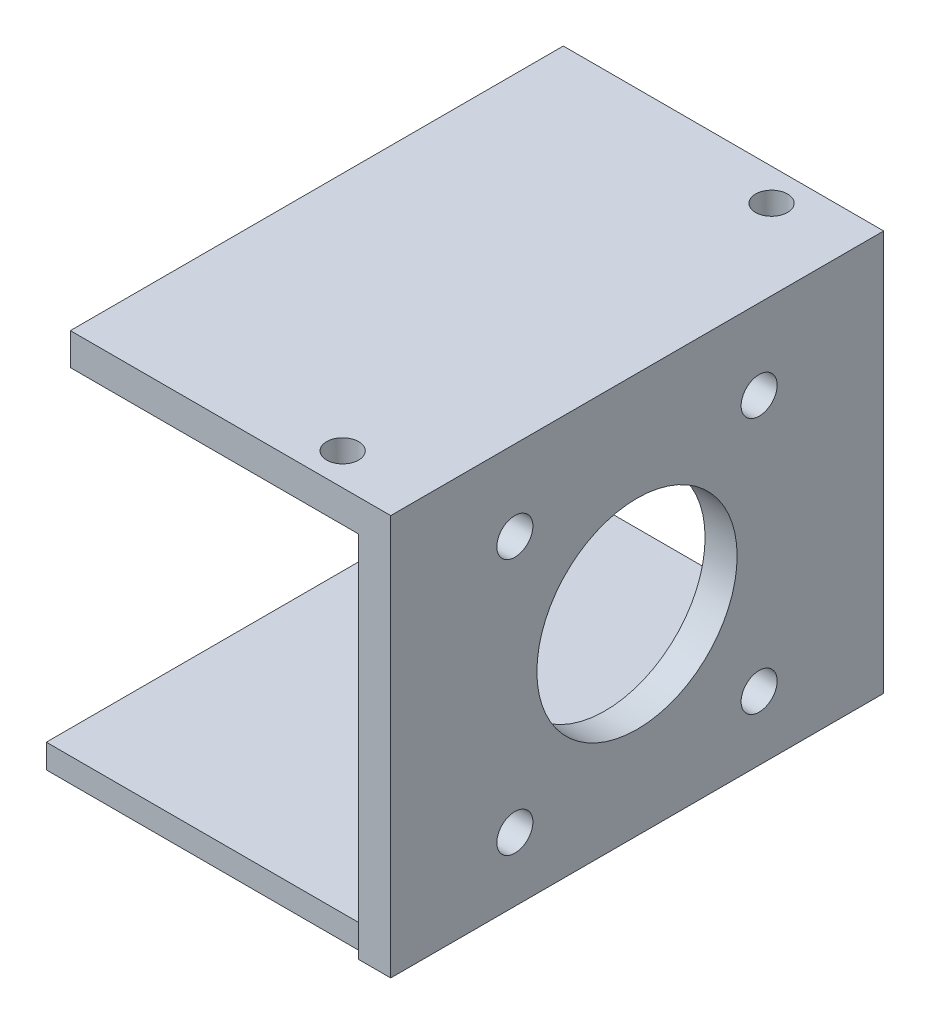
ISO-10303-21;
HEADER;
FILE_DESCRIPTION(('STEP AP214'),'2;1');
FILE_NAME('part.step','',(''),(''),'','','');
FILE_SCHEMA(('AUTOMOTIVE_DESIGN { 1 0 10303 214 1 1 1 1 }'));
ENDSEC;
DATA;
#1=APPLICATION_CONTEXT('core data for automotive mechanical design processes');
#2=APPLICATION_PROTOCOL_DEFINITION('international standard','automotive_design',2000,#1);
#3=PRODUCT_CONTEXT('',#1,'mechanical');
#4=PRODUCT('Part','Part','',(#3));
#5=PRODUCT_RELATED_PRODUCT_CATEGORY('part','',(#4));
#6=PRODUCT_DEFINITION_FORMATION('','',#4);
#7=PRODUCT_DEFINITION_CONTEXT('part definition',#1,'design');
#8=PRODUCT_DEFINITION('design','',#6,#7);
#9=PRODUCT_DEFINITION_SHAPE('','',#8);
#10=(LENGTH_UNIT() NAMED_UNIT(*) SI_UNIT(.MILLI.,.METRE.));
#11=(NAMED_UNIT(*) PLANE_ANGLE_UNIT() SI_UNIT($,.RADIAN.));
#12=(NAMED_UNIT(*) SI_UNIT($,.STERADIAN.) SOLID_ANGLE_UNIT());
#13=UNCERTAINTY_MEASURE_WITH_UNIT(LENGTH_MEASURE(1.E-05),#10,'distance_accuracy_value','');
#14=(GEOMETRIC_REPRESENTATION_CONTEXT(3) GLOBAL_UNCERTAINTY_ASSIGNED_CONTEXT((#13)) GLOBAL_UNIT_ASSIGNED_CONTEXT((#10,
#11,#12)) REPRESENTATION_CONTEXT('',''));
#15=CARTESIAN_POINT('',(0.,0.,0.));
#16=DIRECTION('',(0.,0.,1.));
#17=DIRECTION('',(1.,0.,0.));
#18=AXIS2_PLACEMENT_3D('',#15,#16,#17);
#19=CARTESIAN_POINT('',(40.,45.,-20.5));
#20=DIRECTION('',(1.,0.,0.));
#21=DIRECTION('',(0.,0.,-1.));
#22=AXIS2_PLACEMENT_3D('',#19,#20,#21);
#23=PLANE('',#22);
#24=CARTESIAN_POINT('',(40.,40.,15.5));
#25=DIRECTION('',(1.,0.,0.));
#26=DIRECTION('',(0.,0.,-1.));
#27=AXIS2_PLACEMENT_3D('',#24,#25,#26);
#28=CIRCLE('',#27,2.25);
#29=CARTESIAN_POINT('',(40.,40.,13.25));
#30=VERTEX_POINT('',#29);
#31=EDGE_CURVE('E226',#30,#30,#28,.T.);
#32=ORIENTED_EDGE('',*,*,#31,.T.);
#33=EDGE_LOOP('',(#32));
#34=FACE_BOUND('',#33,.T.);
#35=CARTESIAN_POINT('',(40.,40.,-15.));
#36=DIRECTION('',(1.,0.,0.));
#37=DIRECTION('',(0.,0.,-1.));
#38=AXIS2_PLACEMENT_3D('',#35,#36,#37);
#39=CIRCLE('',#38,2.25);
#40=CARTESIAN_POINT('',(40.,40.,-17.25));
#41=VERTEX_POINT('',#40);
#42=EDGE_CURVE('E227',#41,#41,#39,.T.);
#43=ORIENTED_EDGE('',*,*,#42,.T.);
#44=EDGE_LOOP('',(#43));
#45=FACE_BOUND('',#44,.T.);
#46=CARTESIAN_POINT('',(40.,8.,15.5));
#47=DIRECTION('',(1.,0.,0.));
#48=DIRECTION('',(0.,0.,-1.));
#49=AXIS2_PLACEMENT_3D('',#46,#47,#48);
#50=CIRCLE('',#49,2.25);
#51=CARTESIAN_POINT('',(40.,8.,13.25));
#52=VERTEX_POINT('',#51);
#53=EDGE_CURVE('E234',#52,#52,#50,.T.);
#54=ORIENTED_EDGE('',*,*,#53,.T.);
#55=EDGE_LOOP('',(#54));
#56=FACE_BOUND('',#55,.T.);
#57=CARTESIAN_POINT('',(40.,8.,-15.));
#58=DIRECTION('',(1.,0.,0.));
#59=DIRECTION('',(0.,0.,-1.));
#60=AXIS2_PLACEMENT_3D('',#57,#58,#59);
#61=CIRCLE('',#60,2.25);
#62=CARTESIAN_POINT('',(40.,8.,-17.25));
#63=VERTEX_POINT('',#62);
#64=EDGE_CURVE('E240',#63,#63,#61,.T.);
#65=ORIENTED_EDGE('',*,*,#64,.T.);
#66=EDGE_LOOP('',(#65));
#67=FACE_BOUND('',#66,.T.);
#68=CARTESIAN_POINT('',(40.,24.,0.250000000000002));
#69=DIRECTION('',(1.,0.,0.));
#70=DIRECTION('',(0.,0.,-1.));
#71=AXIS2_PLACEMENT_3D('',#68,#69,#70);
#72=CIRCLE('',#71,12.5);
#73=CARTESIAN_POINT('',(40.,24.,-12.25));
#74=VERTEX_POINT('',#73);
#75=EDGE_CURVE('E249',#74,#74,#72,.T.);
#76=ORIENTED_EDGE('',*,*,#75,.T.);
#77=EDGE_LOOP('',(#76));
#78=FACE_BOUND('',#77,.T.);
#79=DIRECTION('',(0.,-1.,0.));
#80=VECTOR('',#79,1.);
#81=CARTESIAN_POINT('',(40.,44.1126501213434,30.));
#82=LINE('',#81,#80);
#83=CARTESIAN_POINT('',(40.,3.,30.));
#84=VERTEX_POINT('',#83);
#85=CARTESIAN_POINT('',(40.,0.,30.));
#86=VERTEX_POINT('',#85);
#87=EDGE_CURVE('E171',#84,#86,#82,.T.);
#88=ORIENTED_EDGE('',*,*,#87,.T.);
#89=DIRECTION('',(0.,0.,1.));
#90=VECTOR('',#89,1.);
#91=CARTESIAN_POINT('',(40.,0.,21.));
#92=LINE('',#91,#90);
#93=CARTESIAN_POINT('',(40.,0.,31.));
#94=VERTEX_POINT('',#93);
#95=EDGE_CURVE('E207',#86,#94,#92,.T.);
#96=ORIENTED_EDGE('',*,*,#95,.T.);
#97=DIRECTION('',(0.,1.,0.));
#98=VECTOR('',#97,1.);
#99=CARTESIAN_POINT('',(40.,0.,31.));
#100=LINE('',#99,#98);
#101=CARTESIAN_POINT('',(40.,46.,31.));
#102=VERTEX_POINT('',#101);
#103=EDGE_CURVE('E204',#94,#102,#100,.T.);
#104=ORIENTED_EDGE('',*,*,#103,.T.);
#105=DIRECTION('',(0.,0.,-1.));
#106=VECTOR('',#105,1.);
#107=CARTESIAN_POINT('',(40.,46.,31.));
#108=LINE('',#107,#106);
#109=CARTESIAN_POINT('',(40.,46.,-30.5490564972375));
#110=VERTEX_POINT('',#109);
#111=EDGE_CURVE('E201',#102,#110,#108,.T.);
#112=ORIENTED_EDGE('',*,*,#111,.T.);
#113=DIRECTION('',(0.,-0.999999431346738,0.00106644559212024));
#114=VECTOR('',#113,1.);
#115=CARTESIAN_POINT('',(40.,46.,-30.5490564972375));
#116=LINE('',#115,#114);
#117=CARTESIAN_POINT('',(40.,2.6158050057826E-05,-30.5));
#118=VERTEX_POINT('',#117);
#119=EDGE_CURVE('E198',#110,#118,#116,.T.);
#120=ORIENTED_EDGE('',*,*,#119,.T.);
#121=DIRECTION('',(0.,0.,1.));
#122=VECTOR('',#121,1.);
#123=CARTESIAN_POINT('',(40.,2.6158050057826E-05,-20.5));
#124=LINE('',#123,#122);
#125=CARTESIAN_POINT('',(40.,2.6158050057826E-05,-30.));
#126=VERTEX_POINT('',#125);
#127=EDGE_CURVE('E195',#118,#126,#124,.T.);
#128=ORIENTED_EDGE('',*,*,#127,.T.);
#129=DIRECTION('',(0.,-1.,0.));
#130=VECTOR('',#129,1.);
#131=CARTESIAN_POINT('',(40.,44.1126501213434,-30.));
#132=LINE('',#131,#130);
#133=CARTESIAN_POINT('',(40.,3.,-30.));
#134=VERTEX_POINT('',#133);
#135=EDGE_CURVE('E181',#134,#126,#132,.T.);
#136=ORIENTED_EDGE('',*,*,#135,.F.);
#137=DIRECTION('',(0.,0.,-1.));
#138=VECTOR('',#137,1.);
#139=CARTESIAN_POINT('',(40.,3.,0.));
#140=LINE('',#139,#138);
#141=EDGE_CURVE('E44',#84,#134,#140,.T.);
#142=ORIENTED_EDGE('',*,*,#141,.F.);
#143=EDGE_LOOP('',(#88,#96,#104,#112,#120,#128,#136,#142));
#144=FACE_BOUND('',#143,.T.);
#145=ADVANCED_FACE('F35',(#34,#45,#56,#67,#78,#144),#23,.F.);
#146=CARTESIAN_POINT('',(0.,3.,-20.5));
#147=DIRECTION('',(0.,0.,1.));
#148=DIRECTION('',(1.,0.,0.));
#149=AXIS2_PLACEMENT_3D('',#146,#147,#148);
#150=PLANE('',#149);
#151=DIRECTION('',(0.,-1.,0.));
#152=VECTOR('',#151,1.);
#153=CARTESIAN_POINT('',(40.,44.1126501213434,-20.5));
#154=LINE('',#153,#152);
#155=CARTESIAN_POINT('',(40.,2.61580500593439E-05,-20.5));
#156=VERTEX_POINT('',#155);
#157=CARTESIAN_POINT('',(40.,0.,-20.5));
#158=VERTEX_POINT('',#157);
#159=EDGE_CURVE('E174',#156,#158,#154,.T.);
#160=ORIENTED_EDGE('',*,*,#159,.F.);
#161=DIRECTION('',(1.,0.,0.));
#162=VECTOR('',#161,1.);
#163=CARTESIAN_POINT('',(-36.839354211889,2.6158050057826E-05,-20.5));
#164=LINE('',#163,#162);
#165=CARTESIAN_POINT('',(44.,2.61580500732217E-05,-20.5));
#166=VERTEX_POINT('',#165);
#167=EDGE_CURVE('E214',#156,#166,#164,.T.);
#168=ORIENTED_EDGE('',*,*,#167,.T.);
#169=DIRECTION('',(0.,-1.,0.));
#170=VECTOR('',#169,1.);
#171=CARTESIAN_POINT('',(44.,45.,-20.5));
#172=LINE('',#171,#170);
#173=CARTESIAN_POINT('',(44.,0.,-20.5));
#174=VERTEX_POINT('',#173);
#175=EDGE_CURVE('E255',#166,#174,#172,.T.);
#176=ORIENTED_EDGE('',*,*,#175,.T.);
#177=DIRECTION('',(-1.,0.,0.));
#178=VECTOR('',#177,1.);
#179=CARTESIAN_POINT('',(0.,0.,-20.5));
#180=LINE('',#179,#178);
#181=EDGE_CURVE('E59',#174,#158,#180,.T.);
#182=ORIENTED_EDGE('',*,*,#181,.T.);
#183=EDGE_LOOP('',(#160,#168,#176,#182));
#184=FACE_BOUND('',#183,.T.);
#185=ADVANCED_FACE('F293',(#184),#150,.F.);
#186=CARTESIAN_POINT('',(0.,3.,0.));
#187=DIRECTION('',(1.,0.,0.));
#188=DIRECTION('',(0.,0.,-1.));
#189=AXIS2_PLACEMENT_3D('',#186,#187,#188);
#190=PLANE('',#189);
#191=DIRECTION('',(0.,0.,1.));
#192=VECTOR('',#191,1.);
#193=CARTESIAN_POINT('',(0.,0.,0.));
#194=LINE('',#193,#192);
#195=CARTESIAN_POINT('',(0.,0.,-30.));
#196=VERTEX_POINT('',#195);
#197=CARTESIAN_POINT('',(0.,0.,30.));
#198=VERTEX_POINT('',#197);
#199=EDGE_CURVE('E39',#196,#198,#194,.T.);
#200=ORIENTED_EDGE('',*,*,#199,.T.);
#201=DIRECTION('',(0.,-1.,0.));
#202=VECTOR('',#201,1.);
#203=CARTESIAN_POINT('',(0.,44.1126501213434,30.));
#204=LINE('',#203,#202);
#205=CARTESIAN_POINT('',(0.,3.,30.));
#206=VERTEX_POINT('',#205);
#207=EDGE_CURVE('E160',#206,#198,#204,.T.);
#208=ORIENTED_EDGE('',*,*,#207,.F.);
#209=DIRECTION('',(0.,0.,1.));
#210=VECTOR('',#209,1.);
#211=CARTESIAN_POINT('',(0.,3.,0.));
#212=LINE('',#211,#210);
#213=CARTESIAN_POINT('',(0.,3.,-30.));
#214=VERTEX_POINT('',#213);
#215=EDGE_CURVE('E11',#214,#206,#212,.T.);
#216=ORIENTED_EDGE('',*,*,#215,.F.);
#217=DIRECTION('',(0.,-1.,0.));
#218=VECTOR('',#217,1.);
#219=CARTESIAN_POINT('',(0.,44.1126501213434,-30.));
#220=LINE('',#219,#218);
#221=EDGE_CURVE('E180',#214,#196,#220,.T.);
#222=ORIENTED_EDGE('',*,*,#221,.T.);
#223=EDGE_LOOP('',(#200,#208,#216,#222));
#224=FACE_BOUND('',#223,.T.);
#225=ADVANCED_FACE('F271',(#224),#190,.F.);
#226=CARTESIAN_POINT('',(33.75,3.,-14.25));
#227=DIRECTION('',(0.,-1.,0.));
#228=DIRECTION('',(0.,0.,-1.));
#229=AXIS2_PLACEMENT_3D('',#226,#227,#228);
#230=CYLINDRICAL_SURFACE('',#229,2.5);
#231=CARTESIAN_POINT('',(33.75,3.,-14.25));
#232=DIRECTION('',(0.,1.,0.));
#233=DIRECTION('',(0.,0.,1.));
#234=AXIS2_PLACEMENT_3D('',#231,#232,#233);
#235=CIRCLE('',#234,2.5);
#236=CARTESIAN_POINT('',(33.75,3.,-11.75));
#237=VERTEX_POINT('',#236);
#238=EDGE_CURVE('E261',#237,#237,#235,.T.);
#239=ORIENTED_EDGE('',*,*,#238,.T.);
#240=EDGE_LOOP('',(#239));
#241=FACE_BOUND('',#240,.T.);
#242=CARTESIAN_POINT('',(33.75,0.,-14.25));
#243=DIRECTION('',(0.,1.,0.));
#244=DIRECTION('',(0.,0.,1.));
#245=AXIS2_PLACEMENT_3D('',#242,#243,#244);
#246=CIRCLE('',#245,2.5);
#247=CARTESIAN_POINT('',(33.75,0.,-11.75));
#248=VERTEX_POINT('',#247);
#249=EDGE_CURVE('E267',#248,#248,#246,.T.);
#250=ORIENTED_EDGE('',*,*,#249,.F.);
#251=EDGE_LOOP('',(#250));
#252=FACE_BOUND('',#251,.T.);
#253=ADVANCED_FACE('F365',(#241,#252),#230,.F.);
#254=CARTESIAN_POINT('',(33.75,3.,14.75));
#255=DIRECTION('',(0.,-1.,0.));
#256=DIRECTION('',(0.,0.,-1.));
#257=AXIS2_PLACEMENT_3D('',#254,#255,#256);
#258=CYLINDRICAL_SURFACE('',#257,2.5);
#259=CARTESIAN_POINT('',(33.75,3.,14.75));
#260=DIRECTION('',(0.,1.,0.));
#261=DIRECTION('',(0.,0.,1.));
#262=AXIS2_PLACEMENT_3D('',#259,#260,#261);
#263=CIRCLE('',#262,2.5);
#264=CARTESIAN_POINT('',(33.75,3.,17.25));
#265=VERTEX_POINT('',#264);
#266=EDGE_CURVE('E258',#265,#265,#263,.T.);
#267=ORIENTED_EDGE('',*,*,#266,.T.);
#268=EDGE_LOOP('',(#267));
#269=FACE_BOUND('',#268,.T.);
#270=CARTESIAN_POINT('',(33.75,0.,14.75));
#271=DIRECTION('',(0.,1.,0.));
#272=DIRECTION('',(0.,0.,1.));
#273=AXIS2_PLACEMENT_3D('',#270,#271,#272);
#274=CIRCLE('',#273,2.5);
#275=CARTESIAN_POINT('',(33.75,0.,17.25));
#276=VERTEX_POINT('',#275);
#277=EDGE_CURVE('E257',#276,#276,#274,.T.);
#278=ORIENTED_EDGE('',*,*,#277,.F.);
#279=EDGE_LOOP('',(#278));
#280=FACE_BOUND('',#279,.T.);
#281=ADVANCED_FACE('F37',(#269,#280),#258,.F.);
#282=CARTESIAN_POINT('',(0.,3.,0.));
#283=DIRECTION('',(0.,1.,0.));
#284=DIRECTION('',(0.,0.,1.));
#285=AXIS2_PLACEMENT_3D('',#282,#283,#284);
#286=PLANE('',#285);
#287=ORIENTED_EDGE('',*,*,#266,.F.);
#288=EDGE_LOOP('',(#287));
#289=FACE_BOUND('',#288,.T.);
#290=ORIENTED_EDGE('',*,*,#238,.F.);
#291=EDGE_LOOP('',(#290));
#292=FACE_BOUND('',#291,.T.);
#293=ORIENTED_EDGE('',*,*,#141,.T.);
#294=DIRECTION('',(-1.,0.,0.));
#295=VECTOR('',#294,1.);
#296=CARTESIAN_POINT('',(0.,3.,-30.));
#297=LINE('',#296,#295);
#298=EDGE_CURVE('E186',#134,#214,#297,.T.);
#299=ORIENTED_EDGE('',*,*,#298,.T.);
#300=ORIENTED_EDGE('',*,*,#215,.T.);
#301=DIRECTION('',(1.,0.,0.));
#302=VECTOR('',#301,1.);
#303=CARTESIAN_POINT('',(0.,3.,30.));
#304=LINE('',#303,#302);
#305=EDGE_CURVE('E172',#206,#84,#304,.T.);
#306=ORIENTED_EDGE('',*,*,#305,.T.);
#307=EDGE_LOOP('',(#293,#299,#300,#306));
#308=FACE_BOUND('',#307,.T.);
#309=ADVANCED_FACE('F284',(#289,#292,#308),#286,.T.);
#310=CARTESIAN_POINT('',(0.,0.,0.));
#311=DIRECTION('',(0.,1.,0.));
#312=DIRECTION('',(0.,0.,1.));
#313=AXIS2_PLACEMENT_3D('',#310,#311,#312);
#314=PLANE('',#313);
#315=DIRECTION('',(1.,0.,0.));
#316=VECTOR('',#315,1.);
#317=CARTESIAN_POINT('',(0.,0.,30.));
#318=LINE('',#317,#316);
#319=EDGE_CURVE('E163',#198,#86,#318,.T.);
#320=ORIENTED_EDGE('',*,*,#319,.F.);
#321=ORIENTED_EDGE('',*,*,#199,.F.);
#322=DIRECTION('',(-1.,0.,0.));
#323=VECTOR('',#322,1.);
#324=CARTESIAN_POINT('',(0.,0.,-30.));
#325=LINE('',#324,#323);
#326=CARTESIAN_POINT('',(40.,0.,-30.));
#327=VERTEX_POINT('',#326);
#328=EDGE_CURVE('E177',#327,#196,#325,.T.);
#329=ORIENTED_EDGE('',*,*,#328,.F.);
#330=DIRECTION('',(0.,0.,-1.));
#331=VECTOR('',#330,1.);
#332=CARTESIAN_POINT('',(40.,0.,-30.));
#333=LINE('',#332,#331);
#334=EDGE_CURVE('E182',#158,#327,#333,.T.);
#335=ORIENTED_EDGE('',*,*,#334,.F.);
#336=ORIENTED_EDGE('',*,*,#181,.F.);
#337=DIRECTION('',(0.,0.,-1.));
#338=VECTOR('',#337,1.);
#339=CARTESIAN_POINT('',(44.,0.,-20.5));
#340=LINE('',#339,#338);
#341=CARTESIAN_POINT('',(44.,0.,31.));
#342=VERTEX_POINT('',#341);
#343=EDGE_CURVE('E252',#342,#174,#340,.T.);
#344=ORIENTED_EDGE('',*,*,#343,.F.);
#345=DIRECTION('',(1.,0.,0.));
#346=VECTOR('',#345,1.);
#347=CARTESIAN_POINT('',(-36.839354211889,0.,31.));
#348=LINE('',#347,#346);
#349=EDGE_CURVE('E215',#94,#342,#348,.T.);
#350=ORIENTED_EDGE('',*,*,#349,.F.);
#351=ORIENTED_EDGE('',*,*,#95,.F.);
#352=EDGE_LOOP('',(#320,#321,#329,#335,#336,#344,#350,#351));
#353=FACE_BOUND('',#352,.T.);
#354=ORIENTED_EDGE('',*,*,#277,.T.);
#355=EDGE_LOOP('',(#354));
#356=FACE_BOUND('',#355,.T.);
#357=ORIENTED_EDGE('',*,*,#249,.T.);
#358=EDGE_LOOP('',(#357));
#359=FACE_BOUND('',#358,.T.);
#360=ADVANCED_FACE('F279',(#353,#356,#359),#314,.F.);
#361=CARTESIAN_POINT('',(44.,45.,-20.5));
#362=DIRECTION('',(-1.,0.,0.));
#363=DIRECTION('',(0.,0.,1.));
#364=AXIS2_PLACEMENT_3D('',#361,#362,#363);
#365=PLANE('',#364);
#366=DIRECTION('',(0.,-1.,0.));
#367=VECTOR('',#366,1.);
#368=CARTESIAN_POINT('',(44.,0.,31.));
#369=LINE('',#368,#367);
#370=CARTESIAN_POINT('',(44.,50.,31.));
#371=VERTEX_POINT('',#370);
#372=EDGE_CURVE('E212',#371,#342,#369,.T.);
#373=ORIENTED_EDGE('',*,*,#372,.T.);
#374=ORIENTED_EDGE('',*,*,#343,.T.);
#375=ORIENTED_EDGE('',*,*,#175,.F.);
#376=DIRECTION('',(0.,0.,-1.));
#377=VECTOR('',#376,1.);
#378=CARTESIAN_POINT('',(44.,2.6158050057826E-05,-20.5));
#379=LINE('',#378,#377);
#380=CARTESIAN_POINT('',(44.,2.6158050057826E-05,-30.5));
#381=VERTEX_POINT('',#380);
#382=EDGE_CURVE('E189',#166,#381,#379,.T.);
#383=ORIENTED_EDGE('',*,*,#382,.T.);
#384=DIRECTION('',(0.,0.999999431346738,-0.00106644559212024));
#385=VECTOR('',#384,1.);
#386=CARTESIAN_POINT('',(44.,46.,-30.5490564972375));
#387=LINE('',#386,#385);
#388=CARTESIAN_POINT('',(44.,46.,-30.5490564972375));
#389=VERTEX_POINT('',#388);
#390=EDGE_CURVE('E159',#381,#389,#387,.T.);
#391=ORIENTED_EDGE('',*,*,#390,.T.);
#392=DIRECTION('',(0.,-1.,0.));
#393=VECTOR('',#392,1.);
#394=CARTESIAN_POINT('',(44.,50.,-30.5490564972375));
#395=LINE('',#394,#393);
#396=CARTESIAN_POINT('',(44.,50.,-30.5490564972375));
#397=VERTEX_POINT('',#396);
#398=EDGE_CURVE('E135',#397,#389,#395,.T.);
#399=ORIENTED_EDGE('',*,*,#398,.F.);
#400=DIRECTION('',(0.,0.,-1.));
#401=VECTOR('',#400,1.);
#402=CARTESIAN_POINT('',(44.,50.,-30.5490564972375));
#403=LINE('',#402,#401);
#404=EDGE_CURVE('E142',#371,#397,#403,.T.);
#405=ORIENTED_EDGE('',*,*,#404,.F.);
#406=EDGE_LOOP('',(#373,#374,#375,#383,#391,#399,#405));
#407=FACE_BOUND('',#406,.T.);
#408=CARTESIAN_POINT('',(44.,40.,15.5));
#409=DIRECTION('',(-1.,0.,0.));
#410=DIRECTION('',(0.,0.,1.));
#411=AXIS2_PLACEMENT_3D('',#408,#409,#410);
#412=CIRCLE('',#411,2.25);
#413=CARTESIAN_POINT('',(44.,40.,17.75));
#414=VERTEX_POINT('',#413);
#415=EDGE_CURVE('E223',#414,#414,#412,.T.);
#416=ORIENTED_EDGE('',*,*,#415,.T.);
#417=EDGE_LOOP('',(#416));
#418=FACE_BOUND('',#417,.T.);
#419=CARTESIAN_POINT('',(44.,40.,-15.));
#420=DIRECTION('',(-1.,0.,0.));
#421=DIRECTION('',(0.,0.,1.));
#422=AXIS2_PLACEMENT_3D('',#419,#420,#421);
#423=CIRCLE('',#422,2.25);
#424=CARTESIAN_POINT('',(44.,40.,-12.75));
#425=VERTEX_POINT('',#424);
#426=EDGE_CURVE('E231',#425,#425,#423,.T.);
#427=ORIENTED_EDGE('',*,*,#426,.T.);
#428=EDGE_LOOP('',(#427));
#429=FACE_BOUND('',#428,.T.);
#430=CARTESIAN_POINT('',(44.,8.,15.5));
#431=DIRECTION('',(-1.,0.,0.));
#432=DIRECTION('',(0.,0.,1.));
#433=AXIS2_PLACEMENT_3D('',#430,#431,#432);
#434=CIRCLE('',#433,2.25);
#435=CARTESIAN_POINT('',(44.,8.,17.75));
#436=VERTEX_POINT('',#435);
#437=EDGE_CURVE('E237',#436,#436,#434,.T.);
#438=ORIENTED_EDGE('',*,*,#437,.T.);
#439=EDGE_LOOP('',(#438));
#440=FACE_BOUND('',#439,.T.);
#441=CARTESIAN_POINT('',(44.,8.,-15.));
#442=DIRECTION('',(-1.,0.,0.));
#443=DIRECTION('',(0.,0.,1.));
#444=AXIS2_PLACEMENT_3D('',#441,#442,#443);
#445=CIRCLE('',#444,2.25);
#446=CARTESIAN_POINT('',(44.,8.,-12.75));
#447=VERTEX_POINT('',#446);
#448=EDGE_CURVE('E209',#447,#447,#445,.T.);
#449=ORIENTED_EDGE('',*,*,#448,.T.);
#450=EDGE_LOOP('',(#449));
#451=FACE_BOUND('',#450,.T.);
#452=CARTESIAN_POINT('',(44.,24.,0.250000000000002));
#453=DIRECTION('',(-1.,0.,0.));
#454=DIRECTION('',(0.,0.,1.));
#455=AXIS2_PLACEMENT_3D('',#452,#453,#454);
#456=CIRCLE('',#455,12.5);
#457=CARTESIAN_POINT('',(44.,24.,12.75));
#458=VERTEX_POINT('',#457);
#459=EDGE_CURVE('E230',#458,#458,#456,.T.);
#460=ORIENTED_EDGE('',*,*,#459,.T.);
#461=EDGE_LOOP('',(#460));
#462=FACE_BOUND('',#461,.T.);
#463=ADVANCED_FACE('F155',(#407,#418,#429,#440,#451,#462),#365,.F.);
#464=CARTESIAN_POINT('',(4.64466094067262,24.,0.250000000000002));
#465=DIRECTION('',(1.,0.,0.));
#466=DIRECTION('',(0.,0.,-1.));
#467=AXIS2_PLACEMENT_3D('',#464,#465,#466);
#468=CYLINDRICAL_SURFACE('',#467,12.5);
#469=ORIENTED_EDGE('',*,*,#75,.F.);
#470=EDGE_LOOP('',(#469));
#471=FACE_BOUND('',#470,.T.);
#472=ORIENTED_EDGE('',*,*,#459,.F.);
#473=EDGE_LOOP('',(#472));
#474=FACE_BOUND('',#473,.T.);
#475=ADVANCED_FACE('F399',(#471,#474),#468,.F.);
#476=CARTESIAN_POINT('',(4.64466094067261,8.,-15.));
#477=DIRECTION('',(1.,0.,0.));
#478=DIRECTION('',(0.,0.,-1.));
#479=AXIS2_PLACEMENT_3D('',#476,#477,#478);
#480=CYLINDRICAL_SURFACE('',#479,2.25);
#481=ORIENTED_EDGE('',*,*,#64,.F.);
#482=EDGE_LOOP('',(#481));
#483=FACE_BOUND('',#482,.T.);
#484=ORIENTED_EDGE('',*,*,#448,.F.);
#485=EDGE_LOOP('',(#484));
#486=FACE_BOUND('',#485,.T.);
#487=ADVANCED_FACE('F405',(#483,#486),#480,.F.);
#488=CARTESIAN_POINT('',(4.64466094067263,8.,15.5));
#489=DIRECTION('',(1.,0.,0.));
#490=DIRECTION('',(0.,0.,-1.));
#491=AXIS2_PLACEMENT_3D('',#488,#489,#490);
#492=CYLINDRICAL_SURFACE('',#491,2.25);
#493=ORIENTED_EDGE('',*,*,#53,.F.);
#494=EDGE_LOOP('',(#493));
#495=FACE_BOUND('',#494,.T.);
#496=ORIENTED_EDGE('',*,*,#437,.F.);
#497=EDGE_LOOP('',(#496));
#498=FACE_BOUND('',#497,.T.);
#499=ADVANCED_FACE('F412',(#495,#498),#492,.F.);
#500=CARTESIAN_POINT('',(4.64466094067261,40.,-15.));
#501=DIRECTION('',(1.,0.,0.));
#502=DIRECTION('',(0.,0.,-1.));
#503=AXIS2_PLACEMENT_3D('',#500,#501,#502);
#504=CYLINDRICAL_SURFACE('',#503,2.25);
#505=ORIENTED_EDGE('',*,*,#42,.F.);
#506=EDGE_LOOP('',(#505));
#507=FACE_BOUND('',#506,.T.);
#508=ORIENTED_EDGE('',*,*,#426,.F.);
#509=EDGE_LOOP('',(#508));
#510=FACE_BOUND('',#509,.T.);
#511=ADVANCED_FACE('F420',(#507,#510),#504,.F.);
#512=CARTESIAN_POINT('',(4.64466094067263,40.,15.5));
#513=DIRECTION('',(1.,0.,0.));
#514=DIRECTION('',(0.,0.,-1.));
#515=AXIS2_PLACEMENT_3D('',#512,#513,#514);
#516=CYLINDRICAL_SURFACE('',#515,2.25);
#517=ORIENTED_EDGE('',*,*,#31,.F.);
#518=EDGE_LOOP('',(#517));
#519=FACE_BOUND('',#518,.T.);
#520=ORIENTED_EDGE('',*,*,#415,.F.);
#521=EDGE_LOOP('',(#520));
#522=FACE_BOUND('',#521,.T.);
#523=ADVANCED_FACE('F428',(#519,#522),#516,.F.);
#524=CARTESIAN_POINT('',(-36.839354211889,0.,31.));
#525=DIRECTION('',(0.,0.,1.));
#526=DIRECTION('',(1.,0.,0.));
#527=AXIS2_PLACEMENT_3D('',#524,#525,#526);
#528=PLANE('',#527);
#529=ORIENTED_EDGE('',*,*,#103,.F.);
#530=ORIENTED_EDGE('',*,*,#349,.T.);
#531=ORIENTED_EDGE('',*,*,#372,.F.);
#532=DIRECTION('',(1.,0.,0.));
#533=VECTOR('',#532,1.);
#534=CARTESIAN_POINT('',(44.,50.,31.));
#535=LINE('',#534,#533);
#536=CARTESIAN_POINT('',(4.00000000000003,50.,31.));
#537=VERTEX_POINT('',#536);
#538=EDGE_CURVE('E149',#537,#371,#535,.T.);
#539=ORIENTED_EDGE('',*,*,#538,.F.);
#540=DIRECTION('',(0.,-1.,0.));
#541=VECTOR('',#540,1.);
#542=CARTESIAN_POINT('',(4.00000000000003,50.,31.));
#543=LINE('',#542,#541);
#544=CARTESIAN_POINT('',(4.00000000000003,46.,31.));
#545=VERTEX_POINT('',#544);
#546=EDGE_CURVE('E165',#537,#545,#543,.T.);
#547=ORIENTED_EDGE('',*,*,#546,.T.);
#548=DIRECTION('',(1.,0.,0.));
#549=VECTOR('',#548,1.);
#550=CARTESIAN_POINT('',(44.,46.,31.));
#551=LINE('',#550,#549);
#552=EDGE_CURVE('E152',#545,#102,#551,.T.);
#553=ORIENTED_EDGE('',*,*,#552,.T.);
#554=EDGE_LOOP('',(#529,#530,#531,#539,#547,#553));
#555=FACE_BOUND('',#554,.T.);
#556=ADVANCED_FACE('F314',(#555),#528,.T.);
#557=CARTESIAN_POINT('',(-36.839354211889,46.,-30.5490564972375));
#558=DIRECTION('',(0.,-0.00106644559212024,-0.999999431346738));
#559=DIRECTION('',(0.,0.999999431346738,-0.00106644559212024));
#560=AXIS2_PLACEMENT_3D('',#557,#558,#559);
#561=PLANE('',#560);
#562=ORIENTED_EDGE('',*,*,#119,.F.);
#563=DIRECTION('',(1.,0.,0.));
#564=VECTOR('',#563,1.);
#565=CARTESIAN_POINT('',(-36.839354211889,46.,-30.5490564972375));
#566=LINE('',#565,#564);
#567=EDGE_CURVE('E218',#110,#389,#566,.T.);
#568=ORIENTED_EDGE('',*,*,#567,.T.);
#569=ORIENTED_EDGE('',*,*,#390,.F.);
#570=DIRECTION('',(1.,0.,0.));
#571=VECTOR('',#570,1.);
#572=CARTESIAN_POINT('',(-36.839354211889,2.6158050057826E-05,-30.5));
#573=LINE('',#572,#571);
#574=EDGE_CURVE('E220',#118,#381,#573,.T.);
#575=ORIENTED_EDGE('',*,*,#574,.F.);
#576=EDGE_LOOP('',(#562,#568,#569,#575));
#577=FACE_BOUND('',#576,.T.);
#578=ADVANCED_FACE('F302',(#577),#561,.T.);
#579=CARTESIAN_POINT('',(-36.839354211889,2.6158050057826E-05,-20.5));
#580=DIRECTION('',(0.,-1.,0.));
#581=DIRECTION('',(0.,0.,-1.));
#582=AXIS2_PLACEMENT_3D('',#579,#580,#581);
#583=PLANE('',#582);
#584=ORIENTED_EDGE('',*,*,#127,.F.);
#585=ORIENTED_EDGE('',*,*,#574,.T.);
#586=ORIENTED_EDGE('',*,*,#382,.F.);
#587=ORIENTED_EDGE('',*,*,#167,.F.);
#588=EDGE_CURVE('E199',#126,#156,#124,.T.);
#589=ORIENTED_EDGE('',*,*,#588,.F.);
#590=EDGE_LOOP('',(#584,#585,#586,#587,#589));
#591=FACE_BOUND('',#590,.T.);
#592=ADVANCED_FACE('F298',(#591),#583,.T.);
#593=CARTESIAN_POINT('',(40.,44.1126501213434,-30.));
#594=DIRECTION('',(-1.,0.,0.));
#595=DIRECTION('',(0.,0.,1.));
#596=AXIS2_PLACEMENT_3D('',#593,#594,#595);
#597=PLANE('',#596);
#598=ORIENTED_EDGE('',*,*,#588,.T.);
#599=ORIENTED_EDGE('',*,*,#159,.T.);
#600=ORIENTED_EDGE('',*,*,#334,.T.);
#601=EDGE_CURVE('E185',#126,#327,#132,.T.);
#602=ORIENTED_EDGE('',*,*,#601,.F.);
#603=EDGE_LOOP('',(#598,#599,#600,#602));
#604=FACE_BOUND('',#603,.T.);
#605=ADVANCED_FACE('F292',(#604),#597,.F.);
#606=CARTESIAN_POINT('',(0.,44.1126501213434,-30.));
#607=DIRECTION('',(0.,0.,1.));
#608=DIRECTION('',(1.,0.,0.));
#609=AXIS2_PLACEMENT_3D('',#606,#607,#608);
#610=PLANE('',#609);
#611=ORIENTED_EDGE('',*,*,#298,.F.);
#612=ORIENTED_EDGE('',*,*,#135,.T.);
#613=ORIENTED_EDGE('',*,*,#601,.T.);
#614=ORIENTED_EDGE('',*,*,#328,.T.);
#615=ORIENTED_EDGE('',*,*,#221,.F.);
#616=EDGE_LOOP('',(#611,#612,#613,#614,#615));
#617=FACE_BOUND('',#616,.T.);
#618=ADVANCED_FACE('F287',(#617),#610,.F.);
#619=CARTESIAN_POINT('',(0.,44.1126501213434,30.));
#620=DIRECTION('',(0.,0.,-1.));
#621=DIRECTION('',(-1.,0.,0.));
#622=AXIS2_PLACEMENT_3D('',#619,#620,#621);
#623=PLANE('',#622);
#624=ORIENTED_EDGE('',*,*,#305,.F.);
#625=ORIENTED_EDGE('',*,*,#207,.T.);
#626=ORIENTED_EDGE('',*,*,#319,.T.);
#627=ORIENTED_EDGE('',*,*,#87,.F.);
#628=EDGE_LOOP('',(#624,#625,#626,#627));
#629=FACE_BOUND('',#628,.T.);
#630=ADVANCED_FACE('F278',(#629),#623,.F.);
#631=CARTESIAN_POINT('',(0.,46.,0.));
#632=DIRECTION('',(0.,-1.,0.));
#633=DIRECTION('',(0.,0.,-1.));
#634=AXIS2_PLACEMENT_3D('',#631,#632,#633);
#635=PLANE('',#634);
#636=CARTESIAN_POINT('',(34.,46.,27.));
#637=DIRECTION('',(0.,1.,0.));
#638=DIRECTION('',(0.,0.,1.));
#639=AXIS2_PLACEMENT_3D('',#636,#637,#638);
#640=CIRCLE('',#639,2.);
#641=CARTESIAN_POINT('',(34.,46.,29.));
#642=VERTEX_POINT('',#641);
#643=EDGE_CURVE('E328',#642,#642,#640,.T.);
#644=ORIENTED_EDGE('',*,*,#643,.T.);
#645=EDGE_LOOP('',(#644));
#646=FACE_BOUND('',#645,.T.);
#647=CARTESIAN_POINT('',(34.,46.,-26.5490564972375));
#648=DIRECTION('',(0.,1.,0.));
#649=DIRECTION('',(0.,0.,1.));
#650=AXIS2_PLACEMENT_3D('',#647,#648,#649);
#651=CIRCLE('',#650,2.);
#652=CARTESIAN_POINT('',(34.,46.,-24.5490564972375));
#653=VERTEX_POINT('',#652);
#654=EDGE_CURVE('E322',#653,#653,#651,.T.);
#655=ORIENTED_EDGE('',*,*,#654,.T.);
#656=EDGE_LOOP('',(#655));
#657=FACE_BOUND('',#656,.T.);
#658=ORIENTED_EDGE('',*,*,#111,.F.);
#659=ORIENTED_EDGE('',*,*,#552,.F.);
#660=DIRECTION('',(0.,0.,1.));
#661=VECTOR('',#660,1.);
#662=CARTESIAN_POINT('',(4.00000000000002,46.,-30.5490564972375));
#663=LINE('',#662,#661);
#664=CARTESIAN_POINT('',(4.00000000000002,46.,-30.5490564972375));
#665=VERTEX_POINT('',#664);
#666=EDGE_CURVE('E310',#665,#545,#663,.T.);
#667=ORIENTED_EDGE('',*,*,#666,.F.);
#668=DIRECTION('',(-1.,0.,0.));
#669=VECTOR('',#668,1.);
#670=CARTESIAN_POINT('',(44.,46.,-30.5490564972375));
#671=LINE('',#670,#669);
#672=EDGE_CURVE('E304',#110,#665,#671,.T.);
#673=ORIENTED_EDGE('',*,*,#672,.F.);
#674=EDGE_LOOP('',(#658,#659,#667,#673));
#675=FACE_BOUND('',#674,.T.);
#676=ADVANCED_FACE('F307',(#646,#657,#675),#635,.T.);
#677=CARTESIAN_POINT('',(0.,50.,0.));
#678=DIRECTION('',(0.,-1.,0.));
#679=DIRECTION('',(0.,0.,-1.));
#680=AXIS2_PLACEMENT_3D('',#677,#678,#679);
#681=PLANE('',#680);
#682=ORIENTED_EDGE('',*,*,#404,.T.);
#683=DIRECTION('',(-1.,0.,0.));
#684=VECTOR('',#683,1.);
#685=CARTESIAN_POINT('',(44.,50.,-30.5490564972375));
#686=LINE('',#685,#684);
#687=CARTESIAN_POINT('',(4.00000000000002,50.,-30.5490564972375));
#688=VERTEX_POINT('',#687);
#689=EDGE_CURVE('E131',#397,#688,#686,.T.);
#690=ORIENTED_EDGE('',*,*,#689,.T.);
#691=DIRECTION('',(0.,0.,1.));
#692=VECTOR('',#691,1.);
#693=CARTESIAN_POINT('',(4.00000000000002,50.,-30.5490564972375));
#694=LINE('',#693,#692);
#695=EDGE_CURVE('E141',#688,#537,#694,.T.);
#696=ORIENTED_EDGE('',*,*,#695,.T.);
#697=ORIENTED_EDGE('',*,*,#538,.T.);
#698=EDGE_LOOP('',(#682,#690,#696,#697));
#699=FACE_BOUND('',#698,.T.);
#700=CARTESIAN_POINT('',(34.,50.,-26.5490564972375));
#701=DIRECTION('',(0.,1.,0.));
#702=DIRECTION('',(0.,0.,1.));
#703=AXIS2_PLACEMENT_3D('',#700,#701,#702);
#704=CIRCLE('',#703,2.);
#705=CARTESIAN_POINT('',(34.,50.,-24.5490564972375));
#706=VERTEX_POINT('',#705);
#707=EDGE_CURVE('E311',#706,#706,#704,.T.);
#708=ORIENTED_EDGE('',*,*,#707,.F.);
#709=EDGE_LOOP('',(#708));
#710=FACE_BOUND('',#709,.T.);
#711=CARTESIAN_POINT('',(34.,50.,27.));
#712=DIRECTION('',(0.,1.,0.));
#713=DIRECTION('',(0.,0.,1.));
#714=AXIS2_PLACEMENT_3D('',#711,#712,#713);
#715=CIRCLE('',#714,2.);
#716=CARTESIAN_POINT('',(34.,50.,29.));
#717=VERTEX_POINT('',#716);
#718=EDGE_CURVE('E325',#717,#717,#715,.T.);
#719=ORIENTED_EDGE('',*,*,#718,.F.);
#720=EDGE_LOOP('',(#719));
#721=FACE_BOUND('',#720,.T.);
#722=ADVANCED_FACE('F146',(#699,#710,#721),#681,.F.);
#723=CARTESIAN_POINT('',(44.,50.,-30.5490564972375));
#724=DIRECTION('',(0.,0.,1.));
#725=DIRECTION('',(1.,0.,0.));
#726=AXIS2_PLACEMENT_3D('',#723,#724,#725);
#727=PLANE('',#726);
#728=ORIENTED_EDGE('',*,*,#567,.F.);
#729=ORIENTED_EDGE('',*,*,#672,.T.);
#730=DIRECTION('',(0.,-1.,0.));
#731=VECTOR('',#730,1.);
#732=CARTESIAN_POINT('',(4.00000000000002,50.,-30.5490564972375));
#733=LINE('',#732,#731);
#734=EDGE_CURVE('E138',#688,#665,#733,.T.);
#735=ORIENTED_EDGE('',*,*,#734,.F.);
#736=ORIENTED_EDGE('',*,*,#689,.F.);
#737=ORIENTED_EDGE('',*,*,#398,.T.);
#738=EDGE_LOOP('',(#728,#729,#735,#736,#737));
#739=FACE_BOUND('',#738,.T.);
#740=ADVANCED_FACE('F133',(#739),#727,.F.);
#741=CARTESIAN_POINT('',(4.00000000000002,50.,-30.5490564972375));
#742=DIRECTION('',(1.,0.,0.));
#743=DIRECTION('',(0.,0.,-1.));
#744=AXIS2_PLACEMENT_3D('',#741,#742,#743);
#745=PLANE('',#744);
#746=ORIENTED_EDGE('',*,*,#666,.T.);
#747=ORIENTED_EDGE('',*,*,#546,.F.);
#748=ORIENTED_EDGE('',*,*,#695,.F.);
#749=ORIENTED_EDGE('',*,*,#734,.T.);
#750=EDGE_LOOP('',(#746,#747,#748,#749));
#751=FACE_BOUND('',#750,.T.);
#752=ADVANCED_FACE('F343',(#751),#745,.F.);
#753=CARTESIAN_POINT('',(34.,50.,-26.5490564972375));
#754=DIRECTION('',(0.,-1.,0.));
#755=DIRECTION('',(0.,0.,-1.));
#756=AXIS2_PLACEMENT_3D('',#753,#754,#755);
#757=CYLINDRICAL_SURFACE('',#756,2.);
#758=ORIENTED_EDGE('',*,*,#707,.T.);
#759=EDGE_LOOP('',(#758));
#760=FACE_BOUND('',#759,.T.);
#761=ORIENTED_EDGE('',*,*,#654,.F.);
#762=EDGE_LOOP('',(#761));
#763=FACE_BOUND('',#762,.T.);
#764=ADVANCED_FACE('F495',(#760,#763),#757,.F.);
#765=CARTESIAN_POINT('',(34.,50.,27.));
#766=DIRECTION('',(0.,-1.,0.));
#767=DIRECTION('',(0.,0.,-1.));
#768=AXIS2_PLACEMENT_3D('',#765,#766,#767);
#769=CYLINDRICAL_SURFACE('',#768,2.);
#770=ORIENTED_EDGE('',*,*,#718,.T.);
#771=EDGE_LOOP('',(#770));
#772=FACE_BOUND('',#771,.T.);
#773=ORIENTED_EDGE('',*,*,#643,.F.);
#774=EDGE_LOOP('',(#773));
#775=FACE_BOUND('',#774,.T.);
#776=ADVANCED_FACE('F334',(#772,#775),#769,.F.);
#777=CLOSED_SHELL('',(#145,#185,#225,#253,#281,#309,#360,#463,#475,#487,#499,#511,#523,#556,
#578,#592,#605,#618,#630,#676,#722,#740,#752,#764,#776));
#778=MANIFOLD_SOLID_BREP('B2',#777);
#779=ADVANCED_BREP_SHAPE_REPRESENTATION('',(#18,#778),#14);
#780=SHAPE_DEFINITION_REPRESENTATION(#9,#779);
ENDSEC;
END-ISO-10303-21;
